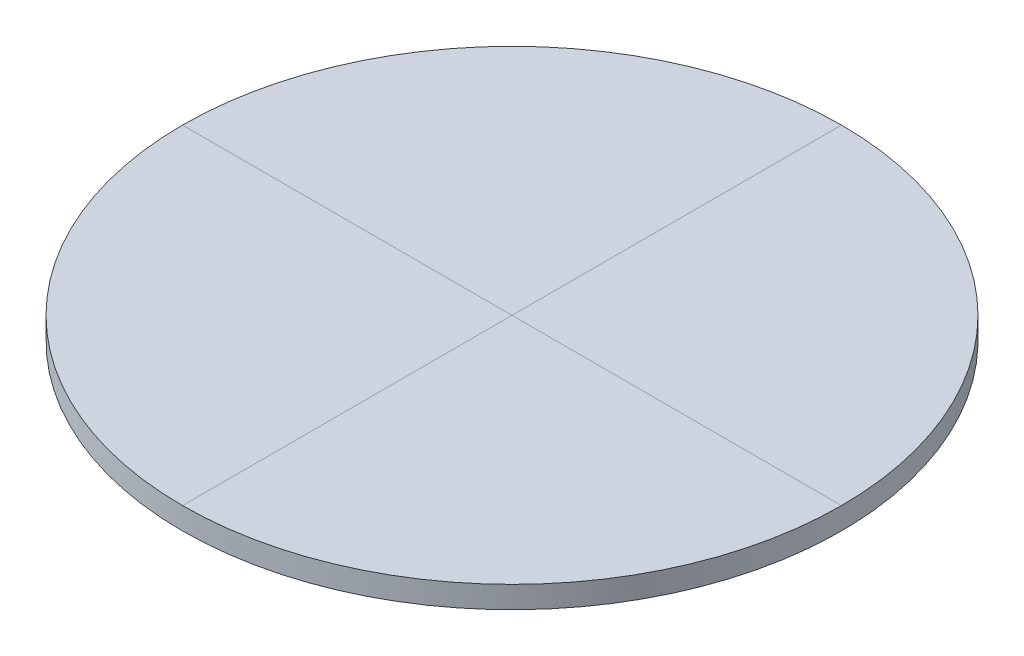
ISO-10303-21;
HEADER;
FILE_DESCRIPTION(('STEP AP214'),'2;1');
FILE_NAME('part.step','',(''),(''),'','','');
FILE_SCHEMA(('AUTOMOTIVE_DESIGN { 1 0 10303 214 1 1 1 1 }'));
ENDSEC;
DATA;
#1=APPLICATION_CONTEXT('core data for automotive mechanical design processes');
#2=APPLICATION_PROTOCOL_DEFINITION('international standard','automotive_design',2000,#1);
#3=PRODUCT_CONTEXT('',#1,'mechanical');
#4=PRODUCT('Part','Part','',(#3));
#5=PRODUCT_RELATED_PRODUCT_CATEGORY('part','',(#4));
#6=PRODUCT_DEFINITION_FORMATION('','',#4);
#7=PRODUCT_DEFINITION_CONTEXT('part definition',#1,'design');
#8=PRODUCT_DEFINITION('design','',#6,#7);
#9=PRODUCT_DEFINITION_SHAPE('','',#8);
#10=(LENGTH_UNIT() NAMED_UNIT(*) SI_UNIT(.MILLI.,.METRE.));
#11=(NAMED_UNIT(*) PLANE_ANGLE_UNIT() SI_UNIT($,.RADIAN.));
#12=(NAMED_UNIT(*) SI_UNIT($,.STERADIAN.) SOLID_ANGLE_UNIT());
#13=UNCERTAINTY_MEASURE_WITH_UNIT(LENGTH_MEASURE(1.E-05),#10,'distance_accuracy_value','');
#14=(GEOMETRIC_REPRESENTATION_CONTEXT(3) GLOBAL_UNCERTAINTY_ASSIGNED_CONTEXT((#13)) GLOBAL_UNIT_ASSIGNED_CONTEXT((#10,
#11,#12)) REPRESENTATION_CONTEXT('',''));
#15=CARTESIAN_POINT('',(0.,0.,0.));
#16=DIRECTION('',(0.,0.,1.));
#17=DIRECTION('',(1.,0.,0.));
#18=AXIS2_PLACEMENT_3D('',#15,#16,#17);
#19=CARTESIAN_POINT('',(0.,1.,0.));
#20=DIRECTION('',(0.,1.,0.));
#21=DIRECTION('',(0.,0.,1.));
#22=AXIS2_PLACEMENT_3D('',#19,#20,#21);
#23=PLANE('',#22);
#24=CARTESIAN_POINT('',(0.,1.,0.));
#25=DIRECTION('',(0.,1.,0.));
#26=DIRECTION('',(0.,0.,1.));
#27=AXIS2_PLACEMENT_3D('',#24,#25,#26);
#28=CIRCLE('',#27,15.);
#29=CARTESIAN_POINT('',(-15.,1.,0.));
#30=VERTEX_POINT('',#29);
#31=CARTESIAN_POINT('',(0.,1.,15.));
#32=VERTEX_POINT('',#31);
#33=EDGE_CURVE('E80',#30,#32,#28,.T.);
#34=ORIENTED_EDGE('',*,*,#33,.T.);
#35=DIRECTION('',(0.,0.,-1.));
#36=VECTOR('',#35,1.);
#37=CARTESIAN_POINT('',(0.,1.,0.));
#38=LINE('',#37,#36);
#39=CARTESIAN_POINT('',(0.,1.,0.));
#40=VERTEX_POINT('',#39);
#41=EDGE_CURVE('E12',#32,#40,#38,.T.);
#42=ORIENTED_EDGE('',*,*,#41,.T.);
#43=DIRECTION('',(1.,0.,0.));
#44=VECTOR('',#43,1.);
#45=CARTESIAN_POINT('',(0.,1.,0.));
#46=LINE('',#45,#44);
#47=EDGE_CURVE('E89',#30,#40,#46,.T.);
#48=ORIENTED_EDGE('',*,*,#47,.F.);
#49=EDGE_LOOP('',(#34,#42,#48));
#50=FACE_BOUND('',#49,.T.);
#51=ADVANCED_FACE('F43',(#50),#23,.T.);
#52=ORIENTED_EDGE('',*,*,#47,.T.);
#53=DIRECTION('',(0.,0.,-1.));
#54=VECTOR('',#53,1.);
#55=CARTESIAN_POINT('',(0.,1.,0.));
#56=LINE('',#55,#54);
#57=CARTESIAN_POINT('',(0.,1.,-15.));
#58=VERTEX_POINT('',#57);
#59=EDGE_CURVE('E52',#40,#58,#56,.T.);
#60=ORIENTED_EDGE('',*,*,#59,.T.);
#61=EDGE_CURVE('E83',#58,#30,#28,.T.);
#62=ORIENTED_EDGE('',*,*,#61,.T.);
#63=EDGE_LOOP('',(#52,#60,#62));
#64=FACE_BOUND('',#63,.T.);
#65=ADVANCED_FACE('F111',(#64),#23,.T.);
#66=ORIENTED_EDGE('',*,*,#59,.F.);
#67=CARTESIAN_POINT('',(15.,1.,0.));
#68=VERTEX_POINT('',#67);
#69=EDGE_CURVE('E74',#40,#68,#46,.T.);
#70=ORIENTED_EDGE('',*,*,#69,.T.);
#71=EDGE_CURVE('E84',#68,#58,#28,.T.);
#72=ORIENTED_EDGE('',*,*,#71,.T.);
#73=EDGE_LOOP('',(#66,#70,#72));
#74=FACE_BOUND('',#73,.T.);
#75=ADVANCED_FACE('F87',(#74),#23,.T.);
#76=CARTESIAN_POINT('',(0.,1.,0.));
#77=DIRECTION('',(0.,-1.,0.));
#78=DIRECTION('',(0.,0.,-1.));
#79=AXIS2_PLACEMENT_3D('',#76,#77,#78);
#80=CYLINDRICAL_SURFACE('',#79,15.);
#81=ORIENTED_EDGE('',*,*,#71,.F.);
#82=EDGE_CURVE('E71',#32,#68,#28,.T.);
#83=ORIENTED_EDGE('',*,*,#82,.F.);
#84=ORIENTED_EDGE('',*,*,#33,.F.);
#85=ORIENTED_EDGE('',*,*,#61,.F.);
#86=EDGE_LOOP('',(#81,#83,#84,#85));
#87=FACE_BOUND('',#86,.T.);
#88=CARTESIAN_POINT('',(0.,0.,0.));
#89=DIRECTION('',(0.,1.,0.));
#90=DIRECTION('',(0.,0.,1.));
#91=AXIS2_PLACEMENT_3D('',#88,#89,#90);
#92=CIRCLE('',#91,15.);
#93=CARTESIAN_POINT('',(0.,0.,15.));
#94=VERTEX_POINT('',#93);
#95=EDGE_CURVE('E81',#94,#94,#92,.T.);
#96=ORIENTED_EDGE('',*,*,#95,.T.);
#97=EDGE_LOOP('',(#96));
#98=FACE_BOUND('',#97,.T.);
#99=ADVANCED_FACE('F45',(#87,#98),#80,.T.);
#100=ORIENTED_EDGE('',*,*,#41,.F.);
#101=ORIENTED_EDGE('',*,*,#82,.T.);
#102=ORIENTED_EDGE('',*,*,#69,.F.);
#103=EDGE_LOOP('',(#100,#101,#102));
#104=FACE_BOUND('',#103,.T.);
#105=ADVANCED_FACE('F73',(#104),#23,.T.);
#106=CARTESIAN_POINT('',(0.,0.,0.));
#107=DIRECTION('',(0.,1.,0.));
#108=DIRECTION('',(0.,0.,1.));
#109=AXIS2_PLACEMENT_3D('',#106,#107,#108);
#110=PLANE('',#109);
#111=ORIENTED_EDGE('',*,*,#95,.F.);
#112=EDGE_LOOP('',(#111));
#113=FACE_BOUND('',#112,.T.);
#114=ADVANCED_FACE('F104',(#113),#110,.F.);
#115=CLOSED_SHELL('',(#51,#65,#75,#99,#105,#114));
#116=MANIFOLD_SOLID_BREP('B2',#115);
#117=ADVANCED_BREP_SHAPE_REPRESENTATION('',(#18,#116),#14);
#118=SHAPE_DEFINITION_REPRESENTATION(#9,#117);
ENDSEC;
END-ISO-10303-21;
